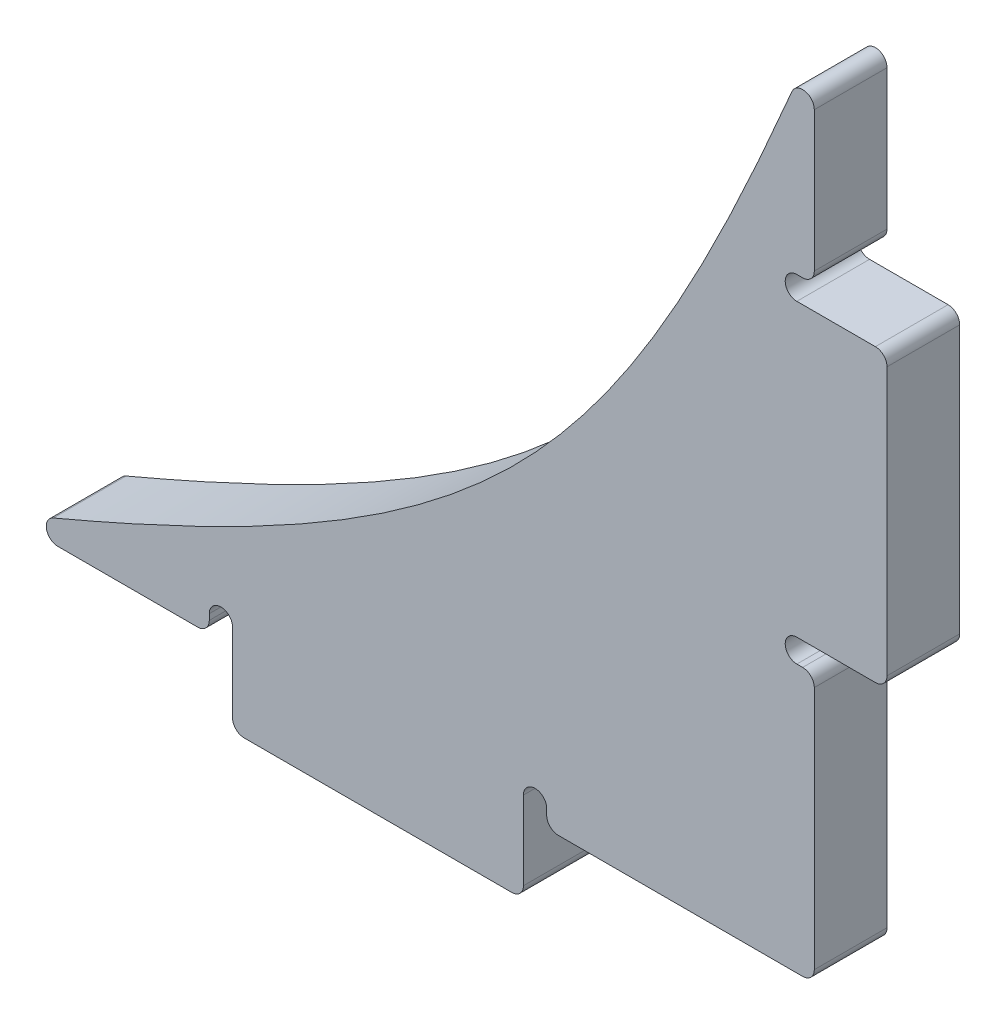
ISO-10303-21;
HEADER;
FILE_DESCRIPTION(('STEP AP214'),'2;1');
FILE_NAME('part.step','',(''),(''),'','','');
FILE_SCHEMA(('AUTOMOTIVE_DESIGN { 1 0 10303 214 1 1 1 1 }'));
ENDSEC;
DATA;
#1=APPLICATION_CONTEXT('core data for automotive mechanical design processes');
#2=APPLICATION_PROTOCOL_DEFINITION('international standard','automotive_design',2000,#1);
#3=PRODUCT_CONTEXT('',#1,'mechanical');
#4=PRODUCT('Part','Part','',(#3));
#5=PRODUCT_RELATED_PRODUCT_CATEGORY('part','',(#4));
#6=PRODUCT_DEFINITION_FORMATION('','',#4);
#7=PRODUCT_DEFINITION_CONTEXT('part definition',#1,'design');
#8=PRODUCT_DEFINITION('design','',#6,#7);
#9=PRODUCT_DEFINITION_SHAPE('','',#8);
#10=(LENGTH_UNIT() NAMED_UNIT(*) SI_UNIT(.MILLI.,.METRE.));
#11=(NAMED_UNIT(*) PLANE_ANGLE_UNIT() SI_UNIT($,.RADIAN.));
#12=(NAMED_UNIT(*) SI_UNIT($,.STERADIAN.) SOLID_ANGLE_UNIT());
#13=UNCERTAINTY_MEASURE_WITH_UNIT(LENGTH_MEASURE(1.E-05),#10,'distance_accuracy_value','');
#14=(GEOMETRIC_REPRESENTATION_CONTEXT(3) GLOBAL_UNCERTAINTY_ASSIGNED_CONTEXT((#13)) GLOBAL_UNIT_ASSIGNED_CONTEXT((#10,
#11,#12)) REPRESENTATION_CONTEXT('',''));
#15=CARTESIAN_POINT('',(0.,0.,0.));
#16=DIRECTION('',(0.,0.,1.));
#17=DIRECTION('',(1.,0.,0.));
#18=AXIS2_PLACEMENT_3D('',#15,#16,#17);
#19=CARTESIAN_POINT('',(22.86,-12.7,3.175));
#20=DIRECTION('',(-1.,0.,0.));
#21=DIRECTION('',(0.,0.,1.));
#22=AXIS2_PLACEMENT_3D('',#19,#20,#21);
#23=PLANE('',#22);
#24=DIRECTION('',(0.,1.,0.));
#25=VECTOR('',#24,1.);
#26=CARTESIAN_POINT('',(22.86,-12.7,0.));
#27=LINE('',#26,#25);
#28=CARTESIAN_POINT('',(22.86,14.224,0.));
#29=VERTEX_POINT('',#28);
#30=CARTESIAN_POINT('',(22.86,20.325877747534,0.));
#31=VERTEX_POINT('',#30);
#32=EDGE_CURVE('E338',#29,#31,#27,.T.);
#33=ORIENTED_EDGE('',*,*,#32,.T.);
#34=DIRECTION('',(0.,0.,-1.));
#35=VECTOR('',#34,1.);
#36=CARTESIAN_POINT('',(22.86,20.325877747534,3.175));
#37=LINE('',#36,#35);
#38=CARTESIAN_POINT('',(22.86,20.325877747534,3.175));
#39=VERTEX_POINT('',#38);
#40=EDGE_CURVE('E439',#31,#39,#37,.F.);
#41=ORIENTED_EDGE('',*,*,#40,.T.);
#42=DIRECTION('',(0.,1.,0.));
#43=VECTOR('',#42,1.);
#44=CARTESIAN_POINT('',(22.86,-12.7,3.175));
#45=LINE('',#44,#43);
#46=CARTESIAN_POINT('',(22.86,14.224,3.175));
#47=VERTEX_POINT('',#46);
#48=EDGE_CURVE('E343',#47,#39,#45,.T.);
#49=ORIENTED_EDGE('',*,*,#48,.F.);
#50=DIRECTION('',(0.,0.,1.));
#51=VECTOR('',#50,1.);
#52=CARTESIAN_POINT('',(22.86,14.224,3.175));
#53=LINE('',#52,#51);
#54=EDGE_CURVE('E437',#47,#29,#53,.F.);
#55=ORIENTED_EDGE('',*,*,#54,.T.);
#56=EDGE_LOOP('',(#33,#41,#49,#55));
#57=FACE_BOUND('',#56,.T.);
#58=ADVANCED_FACE('F36',(#57),#23,.F.);
#59=CARTESIAN_POINT('',(22.86,-12.192,0.));
#60=VERTEX_POINT('',#59);
#61=CARTESIAN_POINT('',(22.86,-1.52399999999999,0.));
#62=VERTEX_POINT('',#61);
#63=EDGE_CURVE('E522',#60,#62,#27,.T.);
#64=ORIENTED_EDGE('',*,*,#63,.T.);
#65=DIRECTION('',(0.,0.,1.));
#66=VECTOR('',#65,1.);
#67=CARTESIAN_POINT('',(22.86,-1.52399999999999,3.175));
#68=LINE('',#67,#66);
#69=CARTESIAN_POINT('',(22.86,-1.52399999999999,3.175));
#70=VERTEX_POINT('',#69);
#71=EDGE_CURVE('E478',#62,#70,#68,.T.);
#72=ORIENTED_EDGE('',*,*,#71,.T.);
#73=CARTESIAN_POINT('',(22.86,-12.192,3.175));
#74=VERTEX_POINT('',#73);
#75=EDGE_CURVE('E339',#74,#70,#45,.T.);
#76=ORIENTED_EDGE('',*,*,#75,.F.);
#77=DIRECTION('',(0.,0.,-1.));
#78=VECTOR('',#77,1.);
#79=CARTESIAN_POINT('',(22.86,-12.192,3.175));
#80=LINE('',#79,#78);
#81=EDGE_CURVE('E475',#74,#60,#80,.T.);
#82=ORIENTED_EDGE('',*,*,#81,.T.);
#83=EDGE_LOOP('',(#64,#72,#76,#82));
#84=FACE_BOUND('',#83,.T.);
#85=ADVANCED_FACE('F367',(#84),#23,.F.);
#86=CARTESIAN_POINT('',(22.86,-12.7,3.175));
#87=DIRECTION('',(0.,1.,0.));
#88=DIRECTION('',(-1.,0.,0.));
#89=AXIS2_PLACEMENT_3D('',#86,#87,#88);
#90=PLANE('',#89);
#91=DIRECTION('',(1.,0.,0.));
#92=VECTOR('',#91,1.);
#93=CARTESIAN_POINT('',(22.86,-12.7,0.));
#94=LINE('',#93,#92);
#95=CARTESIAN_POINT('',(-10.165877747534,-12.7,0.));
#96=VERTEX_POINT('',#95);
#97=CARTESIAN_POINT('',(-4.064,-12.7,0.));
#98=VERTEX_POINT('',#97);
#99=EDGE_CURVE('E505',#96,#98,#94,.T.);
#100=ORIENTED_EDGE('',*,*,#99,.T.);
#101=DIRECTION('',(0.,0.,1.));
#102=VECTOR('',#101,1.);
#103=CARTESIAN_POINT('',(-4.064,-12.7,3.175));
#104=LINE('',#103,#102);
#105=CARTESIAN_POINT('',(-4.064,-12.7,3.175));
#106=VERTEX_POINT('',#105);
#107=EDGE_CURVE('E44',#98,#106,#104,.T.);
#108=ORIENTED_EDGE('',*,*,#107,.T.);
#109=DIRECTION('',(1.,0.,0.));
#110=VECTOR('',#109,1.);
#111=CARTESIAN_POINT('',(22.86,-12.7,3.175));
#112=LINE('',#111,#110);
#113=CARTESIAN_POINT('',(-10.165877747534,-12.7,3.175));
#114=VERTEX_POINT('',#113);
#115=EDGE_CURVE('E350',#114,#106,#112,.T.);
#116=ORIENTED_EDGE('',*,*,#115,.F.);
#117=DIRECTION('',(0.,0.,-1.));
#118=VECTOR('',#117,1.);
#119=CARTESIAN_POINT('',(-10.165877747534,-12.7,3.175));
#120=LINE('',#119,#118);
#121=EDGE_CURVE('E500',#114,#96,#120,.T.);
#122=ORIENTED_EDGE('',*,*,#121,.T.);
#123=EDGE_LOOP('',(#100,#108,#116,#122));
#124=FACE_BOUND('',#123,.T.);
#125=ADVANCED_FACE('F363',(#124),#90,.F.);
#126=CARTESIAN_POINT('',(11.684,-12.7,0.));
#127=VERTEX_POINT('',#126);
#128=CARTESIAN_POINT('',(22.352,-12.7,0.));
#129=VERTEX_POINT('',#128);
#130=EDGE_CURVE('E530',#127,#129,#94,.T.);
#131=ORIENTED_EDGE('',*,*,#130,.T.);
#132=DIRECTION('',(0.,0.,-1.));
#133=VECTOR('',#132,1.);
#134=CARTESIAN_POINT('',(22.352,-12.7,3.175));
#135=LINE('',#134,#133);
#136=CARTESIAN_POINT('',(22.352,-12.7,3.175));
#137=VERTEX_POINT('',#136);
#138=EDGE_CURVE('E485',#129,#137,#135,.F.);
#139=ORIENTED_EDGE('',*,*,#138,.T.);
#140=CARTESIAN_POINT('',(11.684,-12.7,3.175));
#141=VERTEX_POINT('',#140);
#142=EDGE_CURVE('E349',#141,#137,#112,.T.);
#143=ORIENTED_EDGE('',*,*,#142,.F.);
#144=DIRECTION('',(0.,0.,1.));
#145=VECTOR('',#144,1.);
#146=CARTESIAN_POINT('',(11.684,-12.7,3.175));
#147=LINE('',#146,#145);
#148=EDGE_CURVE('E483',#141,#127,#147,.F.);
#149=ORIENTED_EDGE('',*,*,#148,.T.);
#150=EDGE_LOOP('',(#131,#139,#143,#149));
#151=FACE_BOUND('',#150,.T.);
#152=ADVANCED_FACE('F361',(#151),#90,.F.);
#153=CARTESIAN_POINT('',(22.86,22.86,3.175));
#154=CARTESIAN_POINT('',(14.0602561210691,1.48789755157234,3.175));
#155=CARTESIAN_POINT('',(8.67210244842766,-3.90025612106915,3.175));
#156=CARTESIAN_POINT('',(-12.7,-12.7,3.175));
#157=B_SPLINE_CURVE_WITH_KNOTS('',3,(#153,#154,#155,#156),.UNSPECIFIED.,.F.,.F.,(4,4),(0.,1.),.UNSPECIFIED.);
#158=DIRECTION('',(0.,0.,-1.));
#159=VECTOR('',#158,1.);
#160=SURFACE_OF_LINEAR_EXTRUSION('',#157,#159);
#161=CARTESIAN_POINT('',(21.8843521544961,20.5242952180239,3.175));
#162=VERTEX_POINT('',#161);
#163=CARTESIAN_POINT('',(-10.3642952180239,-11.7243521544961,3.175));
#164=VERTEX_POINT('',#163);
#165=EDGE_CURVE('E342',#162,#164,#157,.T.);
#166=ORIENTED_EDGE('',*,*,#165,.F.);
#167=DIRECTION('',(0.,0.,-1.));
#168=VECTOR('',#167,1.);
#169=CARTESIAN_POINT('',(21.8843521544961,20.5242952180239,3.175));
#170=LINE('',#169,#168);
#171=CARTESIAN_POINT('',(21.8843521544961,20.5242952180239,0.));
#172=VERTEX_POINT('',#171);
#173=EDGE_CURVE('E418',#162,#172,#170,.T.);
#174=ORIENTED_EDGE('',*,*,#173,.T.);
#175=CARTESIAN_POINT('',(22.86,22.86,0.));
#176=CARTESIAN_POINT('',(14.0602561210691,1.48789755157234,0.));
#177=CARTESIAN_POINT('',(8.67210244842766,-3.90025612106915,0.));
#178=CARTESIAN_POINT('',(-12.7,-12.7,0.));
#179=B_SPLINE_CURVE_WITH_KNOTS('',3,(#175,#176,#177,#178),.UNSPECIFIED.,.F.,.F.,(4,4),(0.,1.),.UNSPECIFIED.);
#180=CARTESIAN_POINT('',(-10.3642952180239,-11.7243521544961,0.));
#181=VERTEX_POINT('',#180);
#182=EDGE_CURVE('E528',#172,#181,#179,.T.);
#183=ORIENTED_EDGE('',*,*,#182,.T.);
#184=DIRECTION('',(0.,0.,-1.));
#185=VECTOR('',#184,1.);
#186=CARTESIAN_POINT('',(-10.3642952180239,-11.7243521544961,0.));
#187=LINE('',#186,#185);
#188=EDGE_CURVE('E508',#181,#164,#187,.F.);
#189=ORIENTED_EDGE('',*,*,#188,.T.);
#190=EDGE_LOOP('',(#166,#174,#183,#189));
#191=FACE_BOUND('',#190,.T.);
#192=ADVANCED_FACE('F356',(#191),#160,.F.);
#193=CARTESIAN_POINT('',(9.7946344635613,0.365365536438696,3.175));
#194=DIRECTION('',(0.,0.,1.));
#195=DIRECTION('',(1.,0.,0.));
#196=AXIS2_PLACEMENT_3D('',#193,#194,#195);
#197=PLANE('',#196);
#198=ORIENTED_EDGE('',*,*,#48,.T.);
#199=CARTESIAN_POINT('',(22.352,20.325877747534,3.175));
#200=DIRECTION('',(0.,0.,1.));
#201=DIRECTION('',(1.,0.,0.));
#202=AXIS2_PLACEMENT_3D('',#199,#200,#201);
#203=CIRCLE('',#202,0.508);
#204=EDGE_CURVE('E460',#39,#162,#203,.T.);
#205=ORIENTED_EDGE('',*,*,#204,.T.);
#206=ORIENTED_EDGE('',*,*,#165,.T.);
#207=CARTESIAN_POINT('',(-10.165877747534,-12.192,3.175));
#208=DIRECTION('',(0.,0.,1.));
#209=DIRECTION('',(1.,0.,0.));
#210=AXIS2_PLACEMENT_3D('',#207,#208,#209);
#211=CIRCLE('',#210,0.508);
#212=EDGE_CURVE('E441',#164,#114,#211,.T.);
#213=ORIENTED_EDGE('',*,*,#212,.T.);
#214=ORIENTED_EDGE('',*,*,#115,.T.);
#215=CARTESIAN_POINT('',(-4.064,-12.192,3.175));
#216=DIRECTION('',(0.,0.,1.));
#217=DIRECTION('',(1.,0.,0.));
#218=AXIS2_PLACEMENT_3D('',#215,#216,#217);
#219=CIRCLE('',#218,0.508);
#220=CARTESIAN_POINT('',(-3.556,-12.192,3.175));
#221=VERTEX_POINT('',#220);
#222=EDGE_CURVE('E51',#106,#221,#219,.T.);
#223=ORIENTED_EDGE('',*,*,#222,.T.);
#224=DIRECTION('',(0.,-1.,0.));
#225=VECTOR('',#224,1.);
#226=CARTESIAN_POINT('',(-3.556,-11.938,3.175));
#227=LINE('',#226,#225);
#228=CARTESIAN_POINT('',(-3.556,-11.938,3.175));
#229=VERTEX_POINT('',#228);
#230=EDGE_CURVE('E250',#229,#221,#227,.T.);
#231=ORIENTED_EDGE('',*,*,#230,.F.);
#232=CARTESIAN_POINT('',(-3.048,-11.938,3.175));
#233=DIRECTION('',(0.,0.,1.));
#234=DIRECTION('',(1.,0.,0.));
#235=AXIS2_PLACEMENT_3D('',#232,#233,#234);
#236=CIRCLE('',#235,0.507999999999999);
#237=CARTESIAN_POINT('',(-2.54,-11.938,3.175));
#238=VERTEX_POINT('',#237);
#239=EDGE_CURVE('E249',#238,#229,#236,.T.);
#240=ORIENTED_EDGE('',*,*,#239,.F.);
#241=DIRECTION('',(0.,1.,0.));
#242=VECTOR('',#241,1.);
#243=CARTESIAN_POINT('',(-2.54,-15.875,3.175));
#244=LINE('',#243,#242);
#245=CARTESIAN_POINT('',(-2.54,-15.367,3.175));
#246=VERTEX_POINT('',#245);
#247=EDGE_CURVE('E331',#246,#238,#244,.T.);
#248=ORIENTED_EDGE('',*,*,#247,.F.);
#249=CARTESIAN_POINT('',(-2.032,-15.367,3.175));
#250=DIRECTION('',(0.,0.,1.));
#251=DIRECTION('',(1.,0.,0.));
#252=AXIS2_PLACEMENT_3D('',#249,#250,#251);
#253=CIRCLE('',#252,0.508);
#254=CARTESIAN_POINT('',(-2.032,-15.875,3.175));
#255=VERTEX_POINT('',#254);
#256=EDGE_CURVE('E444',#246,#255,#253,.T.);
#257=ORIENTED_EDGE('',*,*,#256,.T.);
#258=DIRECTION('',(-1.,0.,0.));
#259=VECTOR('',#258,1.);
#260=CARTESIAN_POINT('',(-2.54,-15.875,3.175));
#261=LINE('',#260,#259);
#262=CARTESIAN_POINT('',(9.652,-15.875,3.175));
#263=VERTEX_POINT('',#262);
#264=EDGE_CURVE('E328',#263,#255,#261,.T.);
#265=ORIENTED_EDGE('',*,*,#264,.F.);
#266=CARTESIAN_POINT('',(9.652,-15.367,3.175));
#267=DIRECTION('',(0.,0.,1.));
#268=DIRECTION('',(1.,0.,0.));
#269=AXIS2_PLACEMENT_3D('',#266,#267,#268);
#270=CIRCLE('',#269,0.508);
#271=CARTESIAN_POINT('',(10.16,-15.367,3.175));
#272=VERTEX_POINT('',#271);
#273=EDGE_CURVE('E446',#263,#272,#270,.T.);
#274=ORIENTED_EDGE('',*,*,#273,.T.);
#275=DIRECTION('',(0.,1.,0.));
#276=VECTOR('',#275,1.);
#277=CARTESIAN_POINT('',(10.16,-15.875,3.175));
#278=LINE('',#277,#276);
#279=CARTESIAN_POINT('',(10.16,-11.938,3.175));
#280=VERTEX_POINT('',#279);
#281=EDGE_CURVE('E333',#272,#280,#278,.T.);
#282=ORIENTED_EDGE('',*,*,#281,.T.);
#283=CARTESIAN_POINT('',(10.668,-11.938,3.175));
#284=DIRECTION('',(0.,0.,1.));
#285=DIRECTION('',(1.,0.,0.));
#286=AXIS2_PLACEMENT_3D('',#283,#284,#285);
#287=CIRCLE('',#286,0.508000000000001);
#288=CARTESIAN_POINT('',(11.176,-11.938,3.175));
#289=VERTEX_POINT('',#288);
#290=EDGE_CURVE('E273',#289,#280,#287,.T.);
#291=ORIENTED_EDGE('',*,*,#290,.F.);
#292=DIRECTION('',(0.,1.,0.));
#293=VECTOR('',#292,1.);
#294=CARTESIAN_POINT('',(11.176,-12.7,3.175));
#295=LINE('',#294,#293);
#296=CARTESIAN_POINT('',(11.176,-12.192,3.175));
#297=VERTEX_POINT('',#296);
#298=EDGE_CURVE('E276',#297,#289,#295,.T.);
#299=ORIENTED_EDGE('',*,*,#298,.F.);
#300=CARTESIAN_POINT('',(11.684,-12.192,3.175));
#301=DIRECTION('',(0.,0.,1.));
#302=DIRECTION('',(1.,0.,0.));
#303=AXIS2_PLACEMENT_3D('',#300,#301,#302);
#304=CIRCLE('',#303,0.508);
#305=EDGE_CURVE('E448',#297,#141,#304,.T.);
#306=ORIENTED_EDGE('',*,*,#305,.T.);
#307=ORIENTED_EDGE('',*,*,#142,.T.);
#308=CARTESIAN_POINT('',(22.352,-12.192,3.175));
#309=DIRECTION('',(0.,0.,1.));
#310=DIRECTION('',(1.,0.,0.));
#311=AXIS2_PLACEMENT_3D('',#308,#309,#310);
#312=CIRCLE('',#311,0.508);
#313=EDGE_CURVE('E450',#137,#74,#312,.T.);
#314=ORIENTED_EDGE('',*,*,#313,.T.);
#315=ORIENTED_EDGE('',*,*,#75,.T.);
#316=CARTESIAN_POINT('',(22.352,-1.52399999999999,3.175));
#317=DIRECTION('',(0.,0.,1.));
#318=DIRECTION('',(1.,0.,0.));
#319=AXIS2_PLACEMENT_3D('',#316,#317,#318);
#320=CIRCLE('',#319,0.508);
#321=CARTESIAN_POINT('',(22.352,-1.01599999999999,3.175));
#322=VERTEX_POINT('',#321);
#323=EDGE_CURVE('E452',#70,#322,#320,.T.);
#324=ORIENTED_EDGE('',*,*,#323,.T.);
#325=DIRECTION('',(1.,0.,0.));
#326=VECTOR('',#325,1.);
#327=CARTESIAN_POINT('',(22.098,-1.01599999999999,3.175));
#328=LINE('',#327,#326);
#329=CARTESIAN_POINT('',(22.098,-1.01599999999999,3.175));
#330=VERTEX_POINT('',#329);
#331=EDGE_CURVE('E287',#330,#322,#328,.T.);
#332=ORIENTED_EDGE('',*,*,#331,.F.);
#333=CARTESIAN_POINT('',(22.098,-0.507999999999995,3.175));
#334=DIRECTION('',(0.,0.,1.));
#335=DIRECTION('',(1.,0.,0.));
#336=AXIS2_PLACEMENT_3D('',#333,#334,#335);
#337=CIRCLE('',#336,0.507999999999997);
#338=CARTESIAN_POINT('',(22.098,0.,3.175));
#339=VERTEX_POINT('',#338);
#340=EDGE_CURVE('E283',#339,#330,#337,.T.);
#341=ORIENTED_EDGE('',*,*,#340,.F.);
#342=DIRECTION('',(-1.,0.,0.));
#343=VECTOR('',#342,1.);
#344=CARTESIAN_POINT('',(26.035,0.,3.175));
#345=LINE('',#344,#343);
#346=CARTESIAN_POINT('',(25.527,0.,3.175));
#347=VERTEX_POINT('',#346);
#348=EDGE_CURVE('E323',#347,#339,#345,.T.);
#349=ORIENTED_EDGE('',*,*,#348,.F.);
#350=CARTESIAN_POINT('',(25.527,0.508000000000005,3.175));
#351=DIRECTION('',(0.,0.,1.));
#352=DIRECTION('',(1.,0.,0.));
#353=AXIS2_PLACEMENT_3D('',#350,#351,#352);
#354=CIRCLE('',#353,0.508);
#355=CARTESIAN_POINT('',(26.035,0.508000000000005,3.175));
#356=VERTEX_POINT('',#355);
#357=EDGE_CURVE('E454',#347,#356,#354,.T.);
#358=ORIENTED_EDGE('',*,*,#357,.T.);
#359=DIRECTION('',(0.,-1.,0.));
#360=VECTOR('',#359,1.);
#361=CARTESIAN_POINT('',(26.035,0.,3.175));
#362=LINE('',#361,#360);
#363=CARTESIAN_POINT('',(26.035,12.192,3.175));
#364=VERTEX_POINT('',#363);
#365=EDGE_CURVE('E240',#364,#356,#362,.T.);
#366=ORIENTED_EDGE('',*,*,#365,.F.);
#367=CARTESIAN_POINT('',(25.527,12.192,3.175));
#368=DIRECTION('',(0.,0.,1.));
#369=DIRECTION('',(1.,0.,0.));
#370=AXIS2_PLACEMENT_3D('',#367,#368,#369);
#371=CIRCLE('',#370,0.508);
#372=CARTESIAN_POINT('',(25.527,12.7,3.175));
#373=VERTEX_POINT('',#372);
#374=EDGE_CURVE('E456',#364,#373,#371,.T.);
#375=ORIENTED_EDGE('',*,*,#374,.T.);
#376=DIRECTION('',(-1.,0.,0.));
#377=VECTOR('',#376,1.);
#378=CARTESIAN_POINT('',(26.035,12.7,3.175));
#379=LINE('',#378,#377);
#380=CARTESIAN_POINT('',(22.098,12.7,3.175));
#381=VERTEX_POINT('',#380);
#382=EDGE_CURVE('E317',#373,#381,#379,.T.);
#383=ORIENTED_EDGE('',*,*,#382,.T.);
#384=CARTESIAN_POINT('',(22.098,13.208,3.175));
#385=DIRECTION('',(0.,0.,1.));
#386=DIRECTION('',(1.,0.,0.));
#387=AXIS2_PLACEMENT_3D('',#384,#385,#386);
#388=CIRCLE('',#387,0.508000000000002);
#389=CARTESIAN_POINT('',(22.098,13.716,3.175));
#390=VERTEX_POINT('',#389);
#391=EDGE_CURVE('E302',#390,#381,#388,.T.);
#392=ORIENTED_EDGE('',*,*,#391,.F.);
#393=DIRECTION('',(-1.,0.,0.));
#394=VECTOR('',#393,1.);
#395=CARTESIAN_POINT('',(22.86,13.716,3.175));
#396=LINE('',#395,#394);
#397=CARTESIAN_POINT('',(22.352,13.716,3.175));
#398=VERTEX_POINT('',#397);
#399=EDGE_CURVE('E305',#398,#390,#396,.T.);
#400=ORIENTED_EDGE('',*,*,#399,.F.);
#401=CARTESIAN_POINT('',(22.352,14.224,3.175));
#402=DIRECTION('',(0.,0.,1.));
#403=DIRECTION('',(1.,0.,0.));
#404=AXIS2_PLACEMENT_3D('',#401,#402,#403);
#405=CIRCLE('',#404,0.508);
#406=EDGE_CURVE('E458',#398,#47,#405,.T.);
#407=ORIENTED_EDGE('',*,*,#406,.T.);
#408=EDGE_LOOP('',(#198,#205,#206,#213,#214,#223,#231,#240,#248,#257,#265,#274,#282,#291,#299,
#306,#307,#314,#315,#324,#332,#341,#349,#358,#366,#375,#383,#392,#400,#407));
#409=FACE_BOUND('',#408,.T.);
#410=ADVANCED_FACE('F360',(#409),#197,.T.);
#411=CARTESIAN_POINT('',(9.7946344635613,0.365365536438696,0.));
#412=DIRECTION('',(0.,0.,1.));
#413=DIRECTION('',(1.,0.,0.));
#414=AXIS2_PLACEMENT_3D('',#411,#412,#413);
#415=PLANE('',#414);
#416=ORIENTED_EDGE('',*,*,#182,.F.);
#417=CARTESIAN_POINT('',(22.352,20.325877747534,0.));
#418=DIRECTION('',(0.,0.,1.));
#419=DIRECTION('',(1.,0.,0.));
#420=AXIS2_PLACEMENT_3D('',#417,#418,#419);
#421=CIRCLE('',#420,0.508);
#422=EDGE_CURVE('E435',#172,#31,#421,.F.);
#423=ORIENTED_EDGE('',*,*,#422,.T.);
#424=ORIENTED_EDGE('',*,*,#32,.F.);
#425=CARTESIAN_POINT('',(22.352,14.224,0.));
#426=DIRECTION('',(0.,0.,1.));
#427=DIRECTION('',(1.,0.,0.));
#428=AXIS2_PLACEMENT_3D('',#425,#426,#427);
#429=CIRCLE('',#428,0.508);
#430=CARTESIAN_POINT('',(22.352,13.716,0.));
#431=VERTEX_POINT('',#430);
#432=EDGE_CURVE('E433',#29,#431,#429,.F.);
#433=ORIENTED_EDGE('',*,*,#432,.T.);
#434=DIRECTION('',(1.,0.,0.));
#435=VECTOR('',#434,1.);
#436=CARTESIAN_POINT('',(22.86,13.716,0.));
#437=LINE('',#436,#435);
#438=CARTESIAN_POINT('',(22.098,13.716,0.));
#439=VERTEX_POINT('',#438);
#440=EDGE_CURVE('E299',#439,#431,#437,.T.);
#441=ORIENTED_EDGE('',*,*,#440,.F.);
#442=CARTESIAN_POINT('',(22.098,13.208,0.));
#443=DIRECTION('',(0.,0.,1.));
#444=DIRECTION('',(1.,0.,0.));
#445=AXIS2_PLACEMENT_3D('',#442,#443,#444);
#446=CIRCLE('',#445,0.508000000000002);
#447=CARTESIAN_POINT('',(22.098,12.7,0.));
#448=VERTEX_POINT('',#447);
#449=EDGE_CURVE('E296',#448,#439,#446,.F.);
#450=ORIENTED_EDGE('',*,*,#449,.F.);
#451=DIRECTION('',(-1.,0.,0.));
#452=VECTOR('',#451,1.);
#453=CARTESIAN_POINT('',(26.035,12.7,0.));
#454=LINE('',#453,#452);
#455=CARTESIAN_POINT('',(25.527,12.7,0.));
#456=VERTEX_POINT('',#455);
#457=EDGE_CURVE('E319',#456,#448,#454,.T.);
#458=ORIENTED_EDGE('',*,*,#457,.F.);
#459=CARTESIAN_POINT('',(25.527,12.192,0.));
#460=DIRECTION('',(0.,0.,1.));
#461=DIRECTION('',(1.,0.,0.));
#462=AXIS2_PLACEMENT_3D('',#459,#460,#461);
#463=CIRCLE('',#462,0.508);
#464=CARTESIAN_POINT('',(26.035,12.192,0.));
#465=VERTEX_POINT('',#464);
#466=EDGE_CURVE('E431',#456,#465,#463,.F.);
#467=ORIENTED_EDGE('',*,*,#466,.T.);
#468=DIRECTION('',(0.,1.,0.));
#469=VECTOR('',#468,1.);
#470=CARTESIAN_POINT('',(26.035,0.,0.));
#471=LINE('',#470,#469);
#472=CARTESIAN_POINT('',(26.035,0.508000000000005,0.));
#473=VERTEX_POINT('',#472);
#474=EDGE_CURVE('E314',#473,#465,#471,.T.);
#475=ORIENTED_EDGE('',*,*,#474,.F.);
#476=CARTESIAN_POINT('',(25.527,0.508000000000005,0.));
#477=DIRECTION('',(0.,0.,1.));
#478=DIRECTION('',(1.,0.,0.));
#479=AXIS2_PLACEMENT_3D('',#476,#477,#478);
#480=CIRCLE('',#479,0.508);
#481=CARTESIAN_POINT('',(25.527,0.,0.));
#482=VERTEX_POINT('',#481);
#483=EDGE_CURVE('E429',#473,#482,#480,.F.);
#484=ORIENTED_EDGE('',*,*,#483,.T.);
#485=DIRECTION('',(-1.,0.,0.));
#486=VECTOR('',#485,1.);
#487=CARTESIAN_POINT('',(26.035,0.,0.));
#488=LINE('',#487,#486);
#489=CARTESIAN_POINT('',(22.098,0.,0.));
#490=VERTEX_POINT('',#489);
#491=EDGE_CURVE('E321',#482,#490,#488,.T.);
#492=ORIENTED_EDGE('',*,*,#491,.T.);
#493=CARTESIAN_POINT('',(22.098,-0.507999999999995,0.));
#494=DIRECTION('',(0.,0.,1.));
#495=DIRECTION('',(1.,0.,0.));
#496=AXIS2_PLACEMENT_3D('',#493,#494,#495);
#497=CIRCLE('',#496,0.507999999999997);
#498=CARTESIAN_POINT('',(22.098,-1.01599999999999,0.));
#499=VERTEX_POINT('',#498);
#500=EDGE_CURVE('E280',#499,#490,#497,.F.);
#501=ORIENTED_EDGE('',*,*,#500,.F.);
#502=DIRECTION('',(-1.,0.,0.));
#503=VECTOR('',#502,1.);
#504=CARTESIAN_POINT('',(22.098,-1.01599999999999,0.));
#505=LINE('',#504,#503);
#506=CARTESIAN_POINT('',(22.352,-1.01599999999999,0.));
#507=VERTEX_POINT('',#506);
#508=EDGE_CURVE('E270',#507,#499,#505,.T.);
#509=ORIENTED_EDGE('',*,*,#508,.F.);
#510=CARTESIAN_POINT('',(22.352,-1.52399999999999,0.));
#511=DIRECTION('',(0.,0.,1.));
#512=DIRECTION('',(1.,0.,0.));
#513=AXIS2_PLACEMENT_3D('',#510,#511,#512);
#514=CIRCLE('',#513,0.508);
#515=EDGE_CURVE('E427',#507,#62,#514,.F.);
#516=ORIENTED_EDGE('',*,*,#515,.T.);
#517=ORIENTED_EDGE('',*,*,#63,.F.);
#518=CARTESIAN_POINT('',(22.352,-12.192,0.));
#519=DIRECTION('',(0.,0.,1.));
#520=DIRECTION('',(1.,0.,0.));
#521=AXIS2_PLACEMENT_3D('',#518,#519,#520);
#522=CIRCLE('',#521,0.508);
#523=EDGE_CURVE('E425',#60,#129,#522,.F.);
#524=ORIENTED_EDGE('',*,*,#523,.T.);
#525=ORIENTED_EDGE('',*,*,#130,.F.);
#526=CARTESIAN_POINT('',(11.684,-12.192,0.));
#527=DIRECTION('',(0.,0.,1.));
#528=DIRECTION('',(1.,0.,0.));
#529=AXIS2_PLACEMENT_3D('',#526,#527,#528);
#530=CIRCLE('',#529,0.508);
#531=CARTESIAN_POINT('',(11.176,-12.192,0.));
#532=VERTEX_POINT('',#531);
#533=EDGE_CURVE('E423',#127,#532,#530,.F.);
#534=ORIENTED_EDGE('',*,*,#533,.T.);
#535=DIRECTION('',(0.,-1.,0.));
#536=VECTOR('',#535,1.);
#537=CARTESIAN_POINT('',(11.176,-12.7,0.));
#538=LINE('',#537,#536);
#539=CARTESIAN_POINT('',(11.176,-11.938,0.));
#540=VERTEX_POINT('',#539);
#541=EDGE_CURVE('E269',#540,#532,#538,.T.);
#542=ORIENTED_EDGE('',*,*,#541,.F.);
#543=CARTESIAN_POINT('',(10.668,-11.938,0.));
#544=DIRECTION('',(0.,0.,1.));
#545=DIRECTION('',(1.,0.,0.));
#546=AXIS2_PLACEMENT_3D('',#543,#544,#545);
#547=CIRCLE('',#546,0.508000000000001);
#548=CARTESIAN_POINT('',(10.16,-11.938,0.));
#549=VERTEX_POINT('',#548);
#550=EDGE_CURVE('E266',#549,#540,#547,.F.);
#551=ORIENTED_EDGE('',*,*,#550,.F.);
#552=DIRECTION('',(0.,1.,0.));
#553=VECTOR('',#552,1.);
#554=CARTESIAN_POINT('',(10.16,-15.875,0.));
#555=LINE('',#554,#553);
#556=CARTESIAN_POINT('',(10.16,-15.367,0.));
#557=VERTEX_POINT('',#556);
#558=EDGE_CURVE('E335',#557,#549,#555,.T.);
#559=ORIENTED_EDGE('',*,*,#558,.F.);
#560=CARTESIAN_POINT('',(9.652,-15.367,0.));
#561=DIRECTION('',(0.,0.,1.));
#562=DIRECTION('',(1.,0.,0.));
#563=AXIS2_PLACEMENT_3D('',#560,#561,#562);
#564=CIRCLE('',#563,0.508);
#565=CARTESIAN_POINT('',(9.652,-15.875,0.));
#566=VERTEX_POINT('',#565);
#567=EDGE_CURVE('E416',#557,#566,#564,.F.);
#568=ORIENTED_EDGE('',*,*,#567,.T.);
#569=DIRECTION('',(1.,0.,0.));
#570=VECTOR('',#569,1.);
#571=CARTESIAN_POINT('',(-2.54,-15.875,0.));
#572=LINE('',#571,#570);
#573=CARTESIAN_POINT('',(-2.032,-15.875,0.));
#574=VERTEX_POINT('',#573);
#575=EDGE_CURVE('E325',#574,#566,#572,.T.);
#576=ORIENTED_EDGE('',*,*,#575,.F.);
#577=CARTESIAN_POINT('',(-2.032,-15.367,0.));
#578=DIRECTION('',(0.,0.,1.));
#579=DIRECTION('',(1.,0.,0.));
#580=AXIS2_PLACEMENT_3D('',#577,#578,#579);
#581=CIRCLE('',#580,0.508);
#582=CARTESIAN_POINT('',(-2.54,-15.367,0.));
#583=VERTEX_POINT('',#582);
#584=EDGE_CURVE('E413',#574,#583,#581,.F.);
#585=ORIENTED_EDGE('',*,*,#584,.T.);
#586=DIRECTION('',(0.,1.,0.));
#587=VECTOR('',#586,1.);
#588=CARTESIAN_POINT('',(-2.54,-15.875,0.));
#589=LINE('',#588,#587);
#590=CARTESIAN_POINT('',(-2.54,-11.938,0.));
#591=VERTEX_POINT('',#590);
#592=EDGE_CURVE('E255',#583,#591,#589,.T.);
#593=ORIENTED_EDGE('',*,*,#592,.T.);
#594=CARTESIAN_POINT('',(-3.048,-11.938,0.));
#595=DIRECTION('',(0.,0.,1.));
#596=DIRECTION('',(1.,0.,0.));
#597=AXIS2_PLACEMENT_3D('',#594,#595,#596);
#598=CIRCLE('',#597,0.507999999999999);
#599=CARTESIAN_POINT('',(-3.556,-11.938,0.));
#600=VERTEX_POINT('',#599);
#601=EDGE_CURVE('E247',#600,#591,#598,.F.);
#602=ORIENTED_EDGE('',*,*,#601,.F.);
#603=DIRECTION('',(0.,1.,0.));
#604=VECTOR('',#603,1.);
#605=CARTESIAN_POINT('',(-3.556,-11.938,0.));
#606=LINE('',#605,#604);
#607=CARTESIAN_POINT('',(-3.556,-12.192,0.));
#608=VERTEX_POINT('',#607);
#609=EDGE_CURVE('E232',#608,#600,#606,.T.);
#610=ORIENTED_EDGE('',*,*,#609,.F.);
#611=CARTESIAN_POINT('',(-4.064,-12.192,0.));
#612=DIRECTION('',(0.,0.,1.));
#613=DIRECTION('',(1.,0.,0.));
#614=AXIS2_PLACEMENT_3D('',#611,#612,#613);
#615=CIRCLE('',#614,0.508);
#616=EDGE_CURVE('E410',#608,#98,#615,.F.);
#617=ORIENTED_EDGE('',*,*,#616,.T.);
#618=ORIENTED_EDGE('',*,*,#99,.F.);
#619=CARTESIAN_POINT('',(-10.165877747534,-12.192,0.));
#620=DIRECTION('',(0.,0.,1.));
#621=DIRECTION('',(1.,0.,0.));
#622=AXIS2_PLACEMENT_3D('',#619,#620,#621);
#623=CIRCLE('',#622,0.508);
#624=EDGE_CURVE('E414',#96,#181,#623,.F.);
#625=ORIENTED_EDGE('',*,*,#624,.T.);
#626=EDGE_LOOP('',(#416,#423,#424,#433,#441,#450,#458,#467,#475,#484,#492,#501,#509,#516,#517,
#524,#525,#534,#542,#551,#559,#568,#576,#585,#593,#602,#610,#617,#618,#625));
#627=FACE_BOUND('',#626,.T.);
#628=ADVANCED_FACE('F253',(#627),#415,.F.);
#629=CARTESIAN_POINT('',(-2.54,-15.875,3.175));
#630=DIRECTION('',(1.,0.,0.));
#631=DIRECTION('',(0.,1.,0.));
#632=AXIS2_PLACEMENT_3D('',#629,#630,#631);
#633=PLANE('',#632);
#634=ORIENTED_EDGE('',*,*,#592,.F.);
#635=DIRECTION('',(0.,0.,-1.));
#636=VECTOR('',#635,1.);
#637=CARTESIAN_POINT('',(-2.54,-15.367,3.175));
#638=LINE('',#637,#636);
#639=EDGE_CURVE('E498',#583,#246,#638,.F.);
#640=ORIENTED_EDGE('',*,*,#639,.T.);
#641=ORIENTED_EDGE('',*,*,#247,.T.);
#642=DIRECTION('',(0.,0.,1.));
#643=VECTOR('',#642,1.);
#644=CARTESIAN_POINT('',(-2.54,-11.938,-0.00100000000000013));
#645=LINE('',#644,#643);
#646=EDGE_CURVE('E241',#591,#238,#645,.T.);
#647=ORIENTED_EDGE('',*,*,#646,.F.);
#648=EDGE_LOOP('',(#634,#640,#641,#647));
#649=FACE_BOUND('',#648,.T.);
#650=ADVANCED_FACE('F617',(#649),#633,.F.);
#651=CARTESIAN_POINT('',(10.16,-15.875,3.175));
#652=DIRECTION('',(-1.,0.,0.));
#653=DIRECTION('',(0.,-1.,0.));
#654=AXIS2_PLACEMENT_3D('',#651,#652,#653);
#655=PLANE('',#654);
#656=ORIENTED_EDGE('',*,*,#281,.F.);
#657=DIRECTION('',(0.,0.,1.));
#658=VECTOR('',#657,1.);
#659=CARTESIAN_POINT('',(10.16,-15.367,0.));
#660=LINE('',#659,#658);
#661=EDGE_CURVE('E496',#272,#557,#660,.F.);
#662=ORIENTED_EDGE('',*,*,#661,.T.);
#663=ORIENTED_EDGE('',*,*,#558,.T.);
#664=DIRECTION('',(0.,0.,1.));
#665=VECTOR('',#664,1.);
#666=CARTESIAN_POINT('',(10.16,-11.938,-0.00100000000000013));
#667=LINE('',#666,#665);
#668=EDGE_CURVE('E261',#549,#280,#667,.T.);
#669=ORIENTED_EDGE('',*,*,#668,.T.);
#670=EDGE_LOOP('',(#656,#662,#663,#669));
#671=FACE_BOUND('',#670,.T.);
#672=ADVANCED_FACE('F613',(#671),#655,.F.);
#673=CARTESIAN_POINT('',(0.,-15.875,0.));
#674=DIRECTION('',(0.,-1.,0.));
#675=DIRECTION('',(0.,0.,-1.));
#676=AXIS2_PLACEMENT_3D('',#673,#674,#675);
#677=PLANE('',#676);
#678=ORIENTED_EDGE('',*,*,#575,.T.);
#679=DIRECTION('',(0.,0.,1.));
#680=VECTOR('',#679,1.);
#681=CARTESIAN_POINT('',(9.652,-15.875,3.175));
#682=LINE('',#681,#680);
#683=EDGE_CURVE('E493',#566,#263,#682,.T.);
#684=ORIENTED_EDGE('',*,*,#683,.T.);
#685=ORIENTED_EDGE('',*,*,#264,.T.);
#686=DIRECTION('',(0.,0.,-1.));
#687=VECTOR('',#686,1.);
#688=CARTESIAN_POINT('',(-2.032,-15.875,0.));
#689=LINE('',#688,#687);
#690=EDGE_CURVE('E490',#255,#574,#689,.T.);
#691=ORIENTED_EDGE('',*,*,#690,.T.);
#692=EDGE_LOOP('',(#678,#684,#685,#691));
#693=FACE_BOUND('',#692,.T.);
#694=ADVANCED_FACE('F610',(#693),#677,.T.);
#695=CARTESIAN_POINT('',(26.035,0.,3.175));
#696=DIRECTION('',(0.,1.,0.));
#697=DIRECTION('',(0.,0.,1.));
#698=AXIS2_PLACEMENT_3D('',#695,#696,#697);
#699=PLANE('',#698);
#700=ORIENTED_EDGE('',*,*,#491,.F.);
#701=DIRECTION('',(0.,0.,-1.));
#702=VECTOR('',#701,1.);
#703=CARTESIAN_POINT('',(25.527,0.,3.175));
#704=LINE('',#703,#702);
#705=EDGE_CURVE('E473',#482,#347,#704,.F.);
#706=ORIENTED_EDGE('',*,*,#705,.T.);
#707=ORIENTED_EDGE('',*,*,#348,.T.);
#708=DIRECTION('',(0.,0.,1.));
#709=VECTOR('',#708,1.);
#710=CARTESIAN_POINT('',(22.098,0.,-0.00100000000000013));
#711=LINE('',#710,#709);
#712=EDGE_CURVE('E291',#490,#339,#711,.T.);
#713=ORIENTED_EDGE('',*,*,#712,.F.);
#714=EDGE_LOOP('',(#700,#706,#707,#713));
#715=FACE_BOUND('',#714,.T.);
#716=ADVANCED_FACE('F578',(#715),#699,.F.);
#717=CARTESIAN_POINT('',(26.035,12.7,3.175));
#718=DIRECTION('',(0.,-1.,0.));
#719=DIRECTION('',(0.,0.,-1.));
#720=AXIS2_PLACEMENT_3D('',#717,#718,#719);
#721=PLANE('',#720);
#722=ORIENTED_EDGE('',*,*,#382,.F.);
#723=DIRECTION('',(0.,0.,1.));
#724=VECTOR('',#723,1.);
#725=CARTESIAN_POINT('',(25.527,12.7,3.175));
#726=LINE('',#725,#724);
#727=EDGE_CURVE('E471',#373,#456,#726,.F.);
#728=ORIENTED_EDGE('',*,*,#727,.T.);
#729=ORIENTED_EDGE('',*,*,#457,.T.);
#730=DIRECTION('',(0.,0.,1.));
#731=VECTOR('',#730,1.);
#732=CARTESIAN_POINT('',(22.098,12.7,-0.00100000000000013));
#733=LINE('',#732,#731);
#734=EDGE_CURVE('E307',#448,#381,#733,.T.);
#735=ORIENTED_EDGE('',*,*,#734,.T.);
#736=EDGE_LOOP('',(#722,#728,#729,#735));
#737=FACE_BOUND('',#736,.T.);
#738=ADVANCED_FACE('F605',(#737),#721,.F.);
#739=CARTESIAN_POINT('',(26.035,0.,0.));
#740=DIRECTION('',(-1.,0.,0.));
#741=DIRECTION('',(0.,0.,1.));
#742=AXIS2_PLACEMENT_3D('',#739,#740,#741);
#743=PLANE('',#742);
#744=ORIENTED_EDGE('',*,*,#474,.T.);
#745=DIRECTION('',(0.,0.,1.));
#746=VECTOR('',#745,1.);
#747=CARTESIAN_POINT('',(26.035,12.192,0.));
#748=LINE('',#747,#746);
#749=EDGE_CURVE('E468',#465,#364,#748,.T.);
#750=ORIENTED_EDGE('',*,*,#749,.T.);
#751=ORIENTED_EDGE('',*,*,#365,.T.);
#752=DIRECTION('',(0.,0.,-1.));
#753=VECTOR('',#752,1.);
#754=CARTESIAN_POINT('',(26.035,0.508000000000005,0.));
#755=LINE('',#754,#753);
#756=EDGE_CURVE('E465',#356,#473,#755,.T.);
#757=ORIENTED_EDGE('',*,*,#756,.T.);
#758=EDGE_LOOP('',(#744,#750,#751,#757));
#759=FACE_BOUND('',#758,.T.);
#760=ADVANCED_FACE('F568',(#759),#743,.F.);
#761=CARTESIAN_POINT('',(22.098,13.208,-0.00100000000000013));
#762=DIRECTION('',(0.,0.,1.));
#763=DIRECTION('',(1.,0.,0.));
#764=AXIS2_PLACEMENT_3D('',#761,#762,#763);
#765=CYLINDRICAL_SURFACE('',#764,0.508000000000002);
#766=ORIENTED_EDGE('',*,*,#449,.T.);
#767=DIRECTION('',(0.,0.,1.));
#768=VECTOR('',#767,1.);
#769=CARTESIAN_POINT('',(22.098,13.716,-0.00100000000000013));
#770=LINE('',#769,#768);
#771=EDGE_CURVE('E284',#439,#390,#770,.T.);
#772=ORIENTED_EDGE('',*,*,#771,.T.);
#773=ORIENTED_EDGE('',*,*,#391,.T.);
#774=ORIENTED_EDGE('',*,*,#734,.F.);
#775=EDGE_LOOP('',(#766,#772,#773,#774));
#776=FACE_BOUND('',#775,.T.);
#777=ADVANCED_FACE('F558',(#776),#765,.F.);
#778=CARTESIAN_POINT('',(22.86,13.716,-0.00100000000000013));
#779=DIRECTION('',(0.,1.,0.));
#780=DIRECTION('',(-1.,0.,0.));
#781=AXIS2_PLACEMENT_3D('',#778,#779,#780);
#782=PLANE('',#781);
#783=ORIENTED_EDGE('',*,*,#440,.T.);
#784=DIRECTION('',(0.,0.,1.));
#785=VECTOR('',#784,1.);
#786=CARTESIAN_POINT('',(22.352,13.716,-0.00100000000000013));
#787=LINE('',#786,#785);
#788=EDGE_CURVE('E462',#431,#398,#787,.T.);
#789=ORIENTED_EDGE('',*,*,#788,.T.);
#790=ORIENTED_EDGE('',*,*,#399,.T.);
#791=ORIENTED_EDGE('',*,*,#771,.F.);
#792=EDGE_LOOP('',(#783,#789,#790,#791));
#793=FACE_BOUND('',#792,.T.);
#794=ADVANCED_FACE('F553',(#793),#782,.F.);
#795=CARTESIAN_POINT('',(22.098,-0.507999999999995,-0.00100000000000013));
#796=DIRECTION('',(0.,0.,1.));
#797=DIRECTION('',(1.,0.,0.));
#798=AXIS2_PLACEMENT_3D('',#795,#796,#797);
#799=CYLINDRICAL_SURFACE('',#798,0.507999999999997);
#800=ORIENTED_EDGE('',*,*,#500,.T.);
#801=ORIENTED_EDGE('',*,*,#712,.T.);
#802=ORIENTED_EDGE('',*,*,#340,.T.);
#803=DIRECTION('',(0.,0.,1.));
#804=VECTOR('',#803,1.);
#805=CARTESIAN_POINT('',(22.098,-1.01599999999999,-0.00100000000000013));
#806=LINE('',#805,#804);
#807=EDGE_CURVE('E290',#499,#330,#806,.T.);
#808=ORIENTED_EDGE('',*,*,#807,.F.);
#809=EDGE_LOOP('',(#800,#801,#802,#808));
#810=FACE_BOUND('',#809,.T.);
#811=ADVANCED_FACE('F581',(#810),#799,.F.);
#812=CARTESIAN_POINT('',(22.098,-1.01599999999999,-0.00100000000000013));
#813=DIRECTION('',(0.,-1.,0.));
#814=DIRECTION('',(1.,0.,0.));
#815=AXIS2_PLACEMENT_3D('',#812,#813,#814);
#816=PLANE('',#815);
#817=ORIENTED_EDGE('',*,*,#331,.T.);
#818=DIRECTION('',(0.,0.,1.));
#819=VECTOR('',#818,1.);
#820=CARTESIAN_POINT('',(22.352,-1.01599999999999,-0.00100000000000013));
#821=LINE('',#820,#819);
#822=EDGE_CURVE('E481',#322,#507,#821,.F.);
#823=ORIENTED_EDGE('',*,*,#822,.T.);
#824=ORIENTED_EDGE('',*,*,#508,.T.);
#825=ORIENTED_EDGE('',*,*,#807,.T.);
#826=EDGE_LOOP('',(#817,#823,#824,#825));
#827=FACE_BOUND('',#826,.T.);
#828=ADVANCED_FACE('F585',(#827),#816,.F.);
#829=CARTESIAN_POINT('',(10.668,-11.938,-0.00100000000000013));
#830=DIRECTION('',(0.,0.,1.));
#831=DIRECTION('',(1.,0.,0.));
#832=AXIS2_PLACEMENT_3D('',#829,#830,#831);
#833=CYLINDRICAL_SURFACE('',#832,0.508000000000001);
#834=ORIENTED_EDGE('',*,*,#550,.T.);
#835=DIRECTION('',(0.,0.,1.));
#836=VECTOR('',#835,1.);
#837=CARTESIAN_POINT('',(11.176,-11.938,-0.00100000000000013));
#838=LINE('',#837,#836);
#839=EDGE_CURVE('E257',#540,#289,#838,.T.);
#840=ORIENTED_EDGE('',*,*,#839,.T.);
#841=ORIENTED_EDGE('',*,*,#290,.T.);
#842=ORIENTED_EDGE('',*,*,#668,.F.);
#843=EDGE_LOOP('',(#834,#840,#841,#842));
#844=FACE_BOUND('',#843,.T.);
#845=ADVANCED_FACE('F587',(#844),#833,.F.);
#846=CARTESIAN_POINT('',(11.176,-12.7,-0.00100000000000013));
#847=DIRECTION('',(1.,0.,0.));
#848=DIRECTION('',(0.,0.,-1.));
#849=AXIS2_PLACEMENT_3D('',#846,#847,#848);
#850=PLANE('',#849);
#851=ORIENTED_EDGE('',*,*,#541,.T.);
#852=DIRECTION('',(0.,0.,1.));
#853=VECTOR('',#852,1.);
#854=CARTESIAN_POINT('',(11.176,-12.192,-0.00100000000000013));
#855=LINE('',#854,#853);
#856=EDGE_CURVE('E487',#532,#297,#855,.T.);
#857=ORIENTED_EDGE('',*,*,#856,.T.);
#858=ORIENTED_EDGE('',*,*,#298,.T.);
#859=ORIENTED_EDGE('',*,*,#839,.F.);
#860=EDGE_LOOP('',(#851,#857,#858,#859));
#861=FACE_BOUND('',#860,.T.);
#862=ADVANCED_FACE('F593',(#861),#850,.F.);
#863=CARTESIAN_POINT('',(-3.048,-11.938,-0.00100000000000013));
#864=DIRECTION('',(0.,0.,1.));
#865=DIRECTION('',(1.,0.,0.));
#866=AXIS2_PLACEMENT_3D('',#863,#864,#865);
#867=CYLINDRICAL_SURFACE('',#866,0.507999999999999);
#868=ORIENTED_EDGE('',*,*,#601,.T.);
#869=ORIENTED_EDGE('',*,*,#646,.T.);
#870=ORIENTED_EDGE('',*,*,#239,.T.);
#871=DIRECTION('',(0.,0.,1.));
#872=VECTOR('',#871,1.);
#873=CARTESIAN_POINT('',(-3.556,-11.938,-0.00100000000000013));
#874=LINE('',#873,#872);
#875=EDGE_CURVE('E235',#600,#229,#874,.T.);
#876=ORIENTED_EDGE('',*,*,#875,.F.);
#877=EDGE_LOOP('',(#868,#869,#870,#876));
#878=FACE_BOUND('',#877,.T.);
#879=ADVANCED_FACE('F245',(#878),#867,.F.);
#880=CARTESIAN_POINT('',(-3.556,-11.938,-0.00100000000000013));
#881=DIRECTION('',(-1.,0.,0.));
#882=DIRECTION('',(0.,-1.,0.));
#883=AXIS2_PLACEMENT_3D('',#880,#881,#882);
#884=PLANE('',#883);
#885=ORIENTED_EDGE('',*,*,#230,.T.);
#886=DIRECTION('',(0.,0.,1.));
#887=VECTOR('',#886,1.);
#888=CARTESIAN_POINT('',(-3.556,-12.192,-0.00100000000000013));
#889=LINE('',#888,#887);
#890=EDGE_CURVE('E11',#221,#608,#889,.F.);
#891=ORIENTED_EDGE('',*,*,#890,.T.);
#892=ORIENTED_EDGE('',*,*,#609,.T.);
#893=ORIENTED_EDGE('',*,*,#875,.T.);
#894=EDGE_LOOP('',(#885,#891,#892,#893));
#895=FACE_BOUND('',#894,.T.);
#896=ADVANCED_FACE('F234',(#895),#884,.F.);
#897=CARTESIAN_POINT('',(22.352,20.325877747534,1.5875));
#898=DIRECTION('',(0.,0.,-1.));
#899=DIRECTION('',(-1.,0.,0.));
#900=AXIS2_PLACEMENT_3D('',#897,#898,#899);
#901=CYLINDRICAL_SURFACE('',#900,0.508);
#902=ORIENTED_EDGE('',*,*,#204,.F.);
#903=ORIENTED_EDGE('',*,*,#40,.F.);
#904=ORIENTED_EDGE('',*,*,#422,.F.);
#905=ORIENTED_EDGE('',*,*,#173,.F.);
#906=EDGE_LOOP('',(#902,#903,#904,#905));
#907=FACE_BOUND('',#906,.T.);
#908=ADVANCED_FACE('F369',(#907),#901,.T.);
#909=CARTESIAN_POINT('',(22.352,14.224,-0.00100000000000013));
#910=DIRECTION('',(0.,0.,1.));
#911=DIRECTION('',(1.,0.,0.));
#912=AXIS2_PLACEMENT_3D('',#909,#910,#911);
#913=CYLINDRICAL_SURFACE('',#912,0.508);
#914=ORIENTED_EDGE('',*,*,#432,.F.);
#915=ORIENTED_EDGE('',*,*,#54,.F.);
#916=ORIENTED_EDGE('',*,*,#406,.F.);
#917=ORIENTED_EDGE('',*,*,#788,.F.);
#918=EDGE_LOOP('',(#914,#915,#916,#917));
#919=FACE_BOUND('',#918,.T.);
#920=ADVANCED_FACE('F372',(#919),#913,.T.);
#921=CARTESIAN_POINT('',(25.527,12.192,0.));
#922=DIRECTION('',(0.,0.,1.));
#923=DIRECTION('',(1.,0.,0.));
#924=AXIS2_PLACEMENT_3D('',#921,#922,#923);
#925=CYLINDRICAL_SURFACE('',#924,0.508);
#926=ORIENTED_EDGE('',*,*,#466,.F.);
#927=ORIENTED_EDGE('',*,*,#727,.F.);
#928=ORIENTED_EDGE('',*,*,#374,.F.);
#929=ORIENTED_EDGE('',*,*,#749,.F.);
#930=EDGE_LOOP('',(#926,#927,#928,#929));
#931=FACE_BOUND('',#930,.T.);
#932=ADVANCED_FACE('F376',(#931),#925,.T.);
#933=CARTESIAN_POINT('',(25.527,0.508000000000005,0.));
#934=DIRECTION('',(0.,0.,-1.));
#935=DIRECTION('',(-1.,0.,0.));
#936=AXIS2_PLACEMENT_3D('',#933,#934,#935);
#937=CYLINDRICAL_SURFACE('',#936,0.508);
#938=ORIENTED_EDGE('',*,*,#357,.F.);
#939=ORIENTED_EDGE('',*,*,#705,.F.);
#940=ORIENTED_EDGE('',*,*,#483,.F.);
#941=ORIENTED_EDGE('',*,*,#756,.F.);
#942=EDGE_LOOP('',(#938,#939,#940,#941));
#943=FACE_BOUND('',#942,.T.);
#944=ADVANCED_FACE('F380',(#943),#937,.T.);
#945=CARTESIAN_POINT('',(22.352,-1.52399999999999,3.175));
#946=DIRECTION('',(0.,0.,1.));
#947=DIRECTION('',(1.,0.,0.));
#948=AXIS2_PLACEMENT_3D('',#945,#946,#947);
#949=CYLINDRICAL_SURFACE('',#948,0.508);
#950=ORIENTED_EDGE('',*,*,#515,.F.);
#951=ORIENTED_EDGE('',*,*,#822,.F.);
#952=ORIENTED_EDGE('',*,*,#323,.F.);
#953=ORIENTED_EDGE('',*,*,#71,.F.);
#954=EDGE_LOOP('',(#950,#951,#952,#953));
#955=FACE_BOUND('',#954,.T.);
#956=ADVANCED_FACE('F384',(#955),#949,.T.);
#957=CARTESIAN_POINT('',(22.352,-12.192,3.175));
#958=DIRECTION('',(0.,0.,-1.));
#959=DIRECTION('',(-1.,0.,0.));
#960=AXIS2_PLACEMENT_3D('',#957,#958,#959);
#961=CYLINDRICAL_SURFACE('',#960,0.508);
#962=ORIENTED_EDGE('',*,*,#313,.F.);
#963=ORIENTED_EDGE('',*,*,#138,.F.);
#964=ORIENTED_EDGE('',*,*,#523,.F.);
#965=ORIENTED_EDGE('',*,*,#81,.F.);
#966=EDGE_LOOP('',(#962,#963,#964,#965));
#967=FACE_BOUND('',#966,.T.);
#968=ADVANCED_FACE('F388',(#967),#961,.T.);
#969=CARTESIAN_POINT('',(11.684,-12.192,-0.00100000000000013));
#970=DIRECTION('',(0.,0.,1.));
#971=DIRECTION('',(1.,0.,0.));
#972=AXIS2_PLACEMENT_3D('',#969,#970,#971);
#973=CYLINDRICAL_SURFACE('',#972,0.508);
#974=ORIENTED_EDGE('',*,*,#533,.F.);
#975=ORIENTED_EDGE('',*,*,#148,.F.);
#976=ORIENTED_EDGE('',*,*,#305,.F.);
#977=ORIENTED_EDGE('',*,*,#856,.F.);
#978=EDGE_LOOP('',(#974,#975,#976,#977));
#979=FACE_BOUND('',#978,.T.);
#980=ADVANCED_FACE('F392',(#979),#973,.T.);
#981=CARTESIAN_POINT('',(9.652,-15.367,0.));
#982=DIRECTION('',(0.,0.,-1.));
#983=DIRECTION('',(-1.,0.,0.));
#984=AXIS2_PLACEMENT_3D('',#981,#982,#983);
#985=CYLINDRICAL_SURFACE('',#984,0.508);
#986=ORIENTED_EDGE('',*,*,#567,.F.);
#987=ORIENTED_EDGE('',*,*,#661,.F.);
#988=ORIENTED_EDGE('',*,*,#273,.F.);
#989=ORIENTED_EDGE('',*,*,#683,.F.);
#990=EDGE_LOOP('',(#986,#987,#988,#989));
#991=FACE_BOUND('',#990,.T.);
#992=ADVANCED_FACE('F396',(#991),#985,.T.);
#993=CARTESIAN_POINT('',(-2.032,-15.367,0.));
#994=DIRECTION('',(0.,0.,1.));
#995=DIRECTION('',(1.,0.,0.));
#996=AXIS2_PLACEMENT_3D('',#993,#994,#995);
#997=CYLINDRICAL_SURFACE('',#996,0.508);
#998=ORIENTED_EDGE('',*,*,#256,.F.);
#999=ORIENTED_EDGE('',*,*,#639,.F.);
#1000=ORIENTED_EDGE('',*,*,#584,.F.);
#1001=ORIENTED_EDGE('',*,*,#690,.F.);
#1002=EDGE_LOOP('',(#998,#999,#1000,#1001));
#1003=FACE_BOUND('',#1002,.T.);
#1004=ADVANCED_FACE('F400',(#1003),#997,.T.);
#1005=CARTESIAN_POINT('',(-4.064,-12.192,3.175));
#1006=DIRECTION('',(0.,0.,1.));
#1007=DIRECTION('',(1.,0.,0.));
#1008=AXIS2_PLACEMENT_3D('',#1005,#1006,#1007);
#1009=CYLINDRICAL_SURFACE('',#1008,0.508);
#1010=ORIENTED_EDGE('',*,*,#616,.F.);
#1011=ORIENTED_EDGE('',*,*,#890,.F.);
#1012=ORIENTED_EDGE('',*,*,#222,.F.);
#1013=ORIENTED_EDGE('',*,*,#107,.F.);
#1014=EDGE_LOOP('',(#1010,#1011,#1012,#1013));
#1015=FACE_BOUND('',#1014,.T.);
#1016=ADVANCED_FACE('F403',(#1015),#1009,.T.);
#1017=CARTESIAN_POINT('',(-10.165877747534,-12.192,1.5875));
#1018=DIRECTION('',(0.,0.,-1.));
#1019=DIRECTION('',(-1.,0.,0.));
#1020=AXIS2_PLACEMENT_3D('',#1017,#1018,#1019);
#1021=CYLINDRICAL_SURFACE('',#1020,0.508);
#1022=ORIENTED_EDGE('',*,*,#212,.F.);
#1023=ORIENTED_EDGE('',*,*,#188,.F.);
#1024=ORIENTED_EDGE('',*,*,#624,.F.);
#1025=ORIENTED_EDGE('',*,*,#121,.F.);
#1026=EDGE_LOOP('',(#1022,#1023,#1024,#1025));
#1027=FACE_BOUND('',#1026,.T.);
#1028=ADVANCED_FACE('F38',(#1027),#1021,.T.);
#1029=CLOSED_SHELL('',(#58,#85,#125,#152,#192,#410,#628,#650,#672,#694,#716,#738,#760,#777,#794,
#811,#828,#845,#862,#879,#896,#908,#920,#932,#944,#956,#968,#980,#992,#1004,#1016,#1028));
#1030=MANIFOLD_SOLID_BREP('B2',#1029);
#1031=ADVANCED_BREP_SHAPE_REPRESENTATION('',(#18,#1030),#14);
#1032=SHAPE_DEFINITION_REPRESENTATION(#9,#1031);
ENDSEC;
END-ISO-10303-21;
